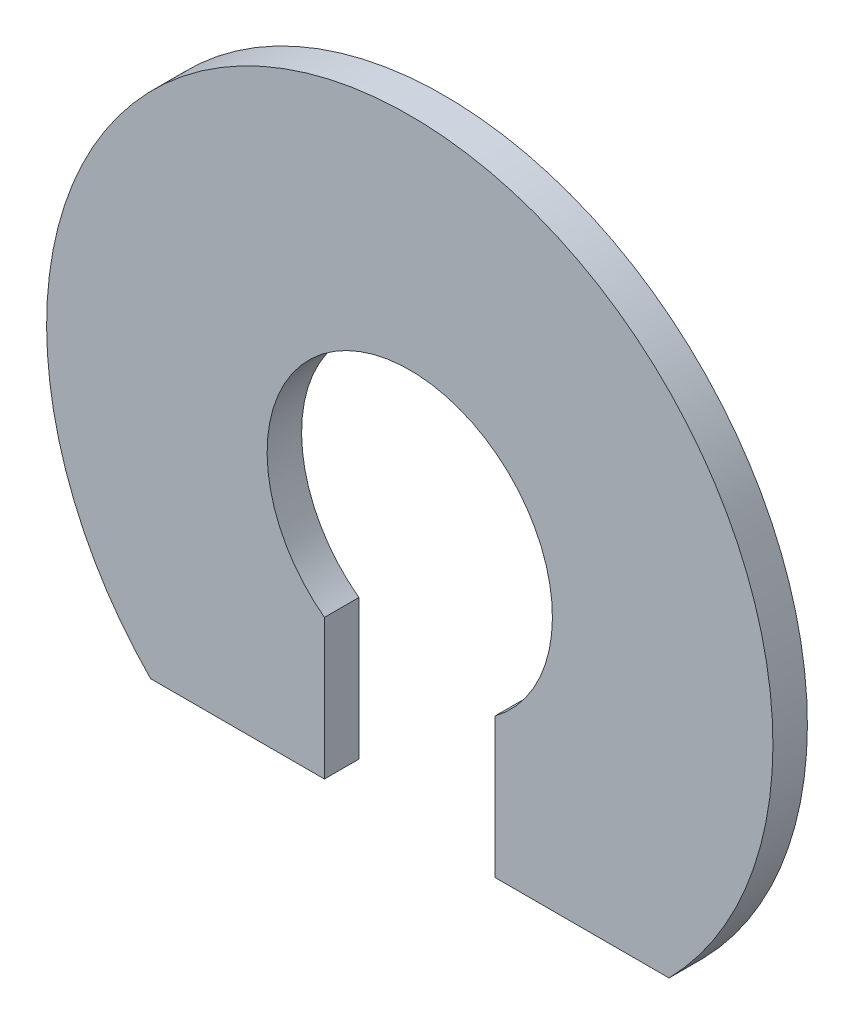
ISO-10303-21;
HEADER;
FILE_DESCRIPTION(('STEP AP214'),'2;1');
FILE_NAME('part.step','',(''),(''),'','','');
FILE_SCHEMA(('AUTOMOTIVE_DESIGN { 1 0 10303 214 1 1 1 1 }'));
ENDSEC;
DATA;
#1=APPLICATION_CONTEXT('core data for automotive mechanical design processes');
#2=APPLICATION_PROTOCOL_DEFINITION('international standard','automotive_design',2000,#1);
#3=PRODUCT_CONTEXT('',#1,'mechanical');
#4=PRODUCT('Part','Part','',(#3));
#5=PRODUCT_RELATED_PRODUCT_CATEGORY('part','',(#4));
#6=PRODUCT_DEFINITION_FORMATION('','',#4);
#7=PRODUCT_DEFINITION_CONTEXT('part definition',#1,'design');
#8=PRODUCT_DEFINITION('design','',#6,#7);
#9=PRODUCT_DEFINITION_SHAPE('','',#8);
#10=(LENGTH_UNIT() NAMED_UNIT(*) SI_UNIT(.MILLI.,.METRE.));
#11=(NAMED_UNIT(*) PLANE_ANGLE_UNIT() SI_UNIT($,.RADIAN.));
#12=(NAMED_UNIT(*) SI_UNIT($,.STERADIAN.) SOLID_ANGLE_UNIT());
#13=UNCERTAINTY_MEASURE_WITH_UNIT(LENGTH_MEASURE(1.E-05),#10,'distance_accuracy_value','');
#14=(GEOMETRIC_REPRESENTATION_CONTEXT(3) GLOBAL_UNCERTAINTY_ASSIGNED_CONTEXT((#13)) GLOBAL_UNIT_ASSIGNED_CONTEXT((#10,
#11,#12)) REPRESENTATION_CONTEXT('',''));
#15=CARTESIAN_POINT('',(0.,0.,0.));
#16=DIRECTION('',(0.,0.,1.));
#17=DIRECTION('',(1.,0.,0.));
#18=AXIS2_PLACEMENT_3D('',#15,#16,#17);
#19=CARTESIAN_POINT('',(0.,0.,0.635));
#20=DIRECTION('',(0.,0.,1.));
#21=DIRECTION('',(1.,0.,0.));
#22=AXIS2_PLACEMENT_3D('',#19,#20,#21);
#23=PLANE('',#22);
#24=DIRECTION('',(0.,1.,0.));
#25=VECTOR('',#24,1.);
#26=CARTESIAN_POINT('',(1.5727215029715,-0.571084015594491,0.635));
#27=LINE('',#26,#25);
#28=CARTESIAN_POINT('',(1.5727215029715,-4.68671598440551,0.635));
#29=VERTEX_POINT('',#28);
#30=CARTESIAN_POINT('',(1.5727215029715,-2.10657596209847,0.635));
#31=VERTEX_POINT('',#30);
#32=EDGE_CURVE('E103',#29,#31,#27,.T.);
#33=ORIENTED_EDGE('',*,*,#32,.F.);
#34=DIRECTION('',(-1.,0.,0.));
#35=VECTOR('',#34,1.);
#36=CARTESIAN_POINT('',(0.,-4.68671598440551,0.635));
#37=LINE('',#36,#35);
#38=CARTESIAN_POINT('',(4.77803345441594,-4.68671598440551,0.635));
#39=VERTEX_POINT('',#38);
#40=EDGE_CURVE('E108',#39,#29,#37,.T.);
#41=ORIENTED_EDGE('',*,*,#40,.F.);
#42=CARTESIAN_POINT('',(0.,0.,0.635));
#43=DIRECTION('',(0.,0.,1.));
#44=DIRECTION('',(1.,0.,0.));
#45=AXIS2_PLACEMENT_3D('',#42,#43,#44);
#46=CIRCLE('',#45,6.6929);
#47=CARTESIAN_POINT('',(-4.77803345441594,-4.68671598440551,0.635));
#48=VERTEX_POINT('',#47);
#49=EDGE_CURVE('E121',#39,#48,#46,.T.);
#50=ORIENTED_EDGE('',*,*,#49,.T.);
#51=DIRECTION('',(-1.,0.,0.));
#52=VECTOR('',#51,1.);
#53=CARTESIAN_POINT('',(0.,-4.68671598440551,0.635));
#54=LINE('',#53,#52);
#55=CARTESIAN_POINT('',(-1.5727215029715,-4.68671598440551,0.635));
#56=VERTEX_POINT('',#55);
#57=EDGE_CURVE('E107',#56,#48,#54,.T.);
#58=ORIENTED_EDGE('',*,*,#57,.F.);
#59=DIRECTION('',(0.,-1.,0.));
#60=VECTOR('',#59,1.);
#61=CARTESIAN_POINT('',(-1.5727215029715,-0.571084015594491,0.635));
#62=LINE('',#61,#60);
#63=CARTESIAN_POINT('',(-1.5727215029715,-2.10657596209847,0.635));
#64=VERTEX_POINT('',#63);
#65=EDGE_CURVE('E49',#64,#56,#62,.T.);
#66=ORIENTED_EDGE('',*,*,#65,.F.);
#67=CARTESIAN_POINT('',(0.,0.,0.635));
#68=DIRECTION('',(0.,0.,1.));
#69=DIRECTION('',(1.,0.,0.));
#70=AXIS2_PLACEMENT_3D('',#67,#68,#69);
#71=CIRCLE('',#70,2.6289);
#72=EDGE_CURVE('E116',#31,#64,#71,.T.);
#73=ORIENTED_EDGE('',*,*,#72,.F.);
#74=EDGE_LOOP('',(#33,#41,#50,#58,#66,#73));
#75=FACE_BOUND('',#74,.T.);
#76=ADVANCED_FACE('F34',(#75),#23,.T.);
#77=CARTESIAN_POINT('',(0.,0.,0.));
#78=DIRECTION('',(0.,0.,1.));
#79=DIRECTION('',(1.,0.,0.));
#80=AXIS2_PLACEMENT_3D('',#77,#78,#79);
#81=PLANE('',#80);
#82=DIRECTION('',(-1.,0.,0.));
#83=VECTOR('',#82,1.);
#84=CARTESIAN_POINT('',(0.,-4.68671598440551,0.));
#85=LINE('',#84,#83);
#86=CARTESIAN_POINT('',(4.77803345441594,-4.68671598440551,0.));
#87=VERTEX_POINT('',#86);
#88=CARTESIAN_POINT('',(1.5727215029715,-4.68671598440551,0.));
#89=VERTEX_POINT('',#88);
#90=EDGE_CURVE('E112',#87,#89,#85,.T.);
#91=ORIENTED_EDGE('',*,*,#90,.T.);
#92=DIRECTION('',(0.,1.,0.));
#93=VECTOR('',#92,1.);
#94=CARTESIAN_POINT('',(1.5727215029715,-0.571084015594491,0.));
#95=LINE('',#94,#93);
#96=CARTESIAN_POINT('',(1.5727215029715,-2.10657596209847,0.));
#97=VERTEX_POINT('',#96);
#98=EDGE_CURVE('E57',#89,#97,#95,.T.);
#99=ORIENTED_EDGE('',*,*,#98,.T.);
#100=CARTESIAN_POINT('',(0.,0.,0.));
#101=DIRECTION('',(0.,0.,1.));
#102=DIRECTION('',(1.,0.,0.));
#103=AXIS2_PLACEMENT_3D('',#100,#101,#102);
#104=CIRCLE('',#103,2.6289);
#105=CARTESIAN_POINT('',(-1.5727215029715,-2.10657596209847,0.));
#106=VERTEX_POINT('',#105);
#107=EDGE_CURVE('E102',#97,#106,#104,.T.);
#108=ORIENTED_EDGE('',*,*,#107,.T.);
#109=DIRECTION('',(0.,-1.,0.));
#110=VECTOR('',#109,1.);
#111=CARTESIAN_POINT('',(-1.5727215029715,-0.571084015594491,0.));
#112=LINE('',#111,#110);
#113=CARTESIAN_POINT('',(-1.5727215029715,-4.68671598440551,0.));
#114=VERTEX_POINT('',#113);
#115=EDGE_CURVE('E87',#106,#114,#112,.T.);
#116=ORIENTED_EDGE('',*,*,#115,.T.);
#117=DIRECTION('',(-1.,0.,0.));
#118=VECTOR('',#117,1.);
#119=CARTESIAN_POINT('',(0.,-4.68671598440551,0.));
#120=LINE('',#119,#118);
#121=CARTESIAN_POINT('',(-4.77803345441594,-4.68671598440551,0.));
#122=VERTEX_POINT('',#121);
#123=EDGE_CURVE('E99',#114,#122,#120,.T.);
#124=ORIENTED_EDGE('',*,*,#123,.T.);
#125=CARTESIAN_POINT('',(0.,0.,0.));
#126=DIRECTION('',(0.,0.,1.));
#127=DIRECTION('',(1.,0.,0.));
#128=AXIS2_PLACEMENT_3D('',#125,#126,#127);
#129=CIRCLE('',#128,6.6929);
#130=EDGE_CURVE('E119',#87,#122,#129,.T.);
#131=ORIENTED_EDGE('',*,*,#130,.F.);
#132=EDGE_LOOP('',(#91,#99,#108,#116,#124,#131));
#133=FACE_BOUND('',#132,.T.);
#134=ADVANCED_FACE('F97',(#133),#81,.F.);
#135=CARTESIAN_POINT('',(0.,0.,0.635));
#136=DIRECTION('',(0.,0.,-1.));
#137=DIRECTION('',(-1.,0.,0.));
#138=AXIS2_PLACEMENT_3D('',#135,#136,#137);
#139=CYLINDRICAL_SURFACE('',#138,6.6929);
#140=ORIENTED_EDGE('',*,*,#130,.T.);
#141=DIRECTION('',(0.,0.,-1.));
#142=VECTOR('',#141,1.);
#143=CARTESIAN_POINT('',(-4.77803345441594,-4.68671598440551,0.635));
#144=LINE('',#143,#142);
#145=EDGE_CURVE('E11',#122,#48,#144,.F.);
#146=ORIENTED_EDGE('',*,*,#145,.T.);
#147=ORIENTED_EDGE('',*,*,#49,.F.);
#148=DIRECTION('',(0.,0.,-1.));
#149=VECTOR('',#148,1.);
#150=CARTESIAN_POINT('',(4.77803345441594,-4.68671598440551,0.635));
#151=LINE('',#150,#149);
#152=EDGE_CURVE('E42',#39,#87,#151,.T.);
#153=ORIENTED_EDGE('',*,*,#152,.T.);
#154=EDGE_LOOP('',(#140,#146,#147,#153));
#155=FACE_BOUND('',#154,.T.);
#156=ADVANCED_FACE('F36',(#155),#139,.T.);
#157=CARTESIAN_POINT('',(0.,0.,0.635));
#158=DIRECTION('',(0.,0.,-1.));
#159=DIRECTION('',(-1.,0.,0.));
#160=AXIS2_PLACEMENT_3D('',#157,#158,#159);
#161=CYLINDRICAL_SURFACE('',#160,2.6289);
#162=DIRECTION('',(0.,0.,-1.));
#163=VECTOR('',#162,1.);
#164=CARTESIAN_POINT('',(1.5727215029715,-2.10657596209847,0.635));
#165=LINE('',#164,#163);
#166=EDGE_CURVE('E130',#31,#97,#165,.T.);
#167=ORIENTED_EDGE('',*,*,#166,.F.);
#168=ORIENTED_EDGE('',*,*,#72,.T.);
#169=DIRECTION('',(0.,0.,-1.));
#170=VECTOR('',#169,1.);
#171=CARTESIAN_POINT('',(-1.5727215029715,-2.10657596209847,0.635));
#172=LINE('',#171,#170);
#173=EDGE_CURVE('E129',#106,#64,#172,.F.);
#174=ORIENTED_EDGE('',*,*,#173,.F.);
#175=ORIENTED_EDGE('',*,*,#107,.F.);
#176=EDGE_LOOP('',(#167,#168,#174,#175));
#177=FACE_BOUND('',#176,.T.);
#178=ADVANCED_FACE('F143',(#177),#161,.F.);
#179=CARTESIAN_POINT('',(0.,-4.68671598440551,24.3112838973412));
#180=DIRECTION('',(0.,1.,0.));
#181=DIRECTION('',(0.,0.,1.));
#182=AXIS2_PLACEMENT_3D('',#179,#180,#181);
#183=PLANE('',#182);
#184=ORIENTED_EDGE('',*,*,#123,.F.);
#185=DIRECTION('',(0.,0.,1.));
#186=VECTOR('',#185,1.);
#187=CARTESIAN_POINT('',(-1.5727215029715,-4.68671598440551,0.));
#188=LINE('',#187,#186);
#189=EDGE_CURVE('E84',#114,#56,#188,.T.);
#190=ORIENTED_EDGE('',*,*,#189,.T.);
#191=ORIENTED_EDGE('',*,*,#57,.T.);
#192=ORIENTED_EDGE('',*,*,#145,.F.);
#193=EDGE_LOOP('',(#184,#190,#191,#192));
#194=FACE_BOUND('',#193,.T.);
#195=ADVANCED_FACE('F105',(#194),#183,.F.);
#196=CARTESIAN_POINT('',(0.,-4.68671598440551,24.3112838973412));
#197=DIRECTION('',(0.,1.,0.));
#198=DIRECTION('',(0.,0.,1.));
#199=AXIS2_PLACEMENT_3D('',#196,#197,#198);
#200=PLANE('',#199);
#201=ORIENTED_EDGE('',*,*,#40,.T.);
#202=DIRECTION('',(0.,0.,1.));
#203=VECTOR('',#202,1.);
#204=CARTESIAN_POINT('',(1.5727215029715,-4.68671598440551,0.));
#205=LINE('',#204,#203);
#206=EDGE_CURVE('E92',#89,#29,#205,.T.);
#207=ORIENTED_EDGE('',*,*,#206,.F.);
#208=ORIENTED_EDGE('',*,*,#90,.F.);
#209=ORIENTED_EDGE('',*,*,#152,.F.);
#210=EDGE_LOOP('',(#201,#207,#208,#209));
#211=FACE_BOUND('',#210,.T.);
#212=ADVANCED_FACE('F144',(#211),#200,.F.);
#213=CARTESIAN_POINT('',(1.5727215029715,-0.571084015594491,0.));
#214=DIRECTION('',(1.,0.,0.));
#215=DIRECTION('',(0.,0.,-1.));
#216=AXIS2_PLACEMENT_3D('',#213,#214,#215);
#217=PLANE('',#216);
#218=ORIENTED_EDGE('',*,*,#166,.T.);
#219=ORIENTED_EDGE('',*,*,#98,.F.);
#220=ORIENTED_EDGE('',*,*,#206,.T.);
#221=ORIENTED_EDGE('',*,*,#32,.T.);
#222=EDGE_LOOP('',(#218,#219,#220,#221));
#223=FACE_BOUND('',#222,.T.);
#224=ADVANCED_FACE('F139',(#223),#217,.F.);
#225=CARTESIAN_POINT('',(-1.5727215029715,-0.571084015594491,0.));
#226=DIRECTION('',(-1.,0.,0.));
#227=DIRECTION('',(0.,0.,1.));
#228=AXIS2_PLACEMENT_3D('',#225,#226,#227);
#229=PLANE('',#228);
#230=ORIENTED_EDGE('',*,*,#173,.T.);
#231=ORIENTED_EDGE('',*,*,#65,.T.);
#232=ORIENTED_EDGE('',*,*,#189,.F.);
#233=ORIENTED_EDGE('',*,*,#115,.F.);
#234=EDGE_LOOP('',(#230,#231,#232,#233));
#235=FACE_BOUND('',#234,.T.);
#236=ADVANCED_FACE('F86',(#235),#229,.F.);
#237=CLOSED_SHELL('',(#76,#134,#156,#178,#195,#212,#224,#236));
#238=MANIFOLD_SOLID_BREP('B2',#237);
#239=ADVANCED_BREP_SHAPE_REPRESENTATION('',(#18,#238),#14);
#240=SHAPE_DEFINITION_REPRESENTATION(#9,#239);
ENDSEC;
END-ISO-10303-21;
